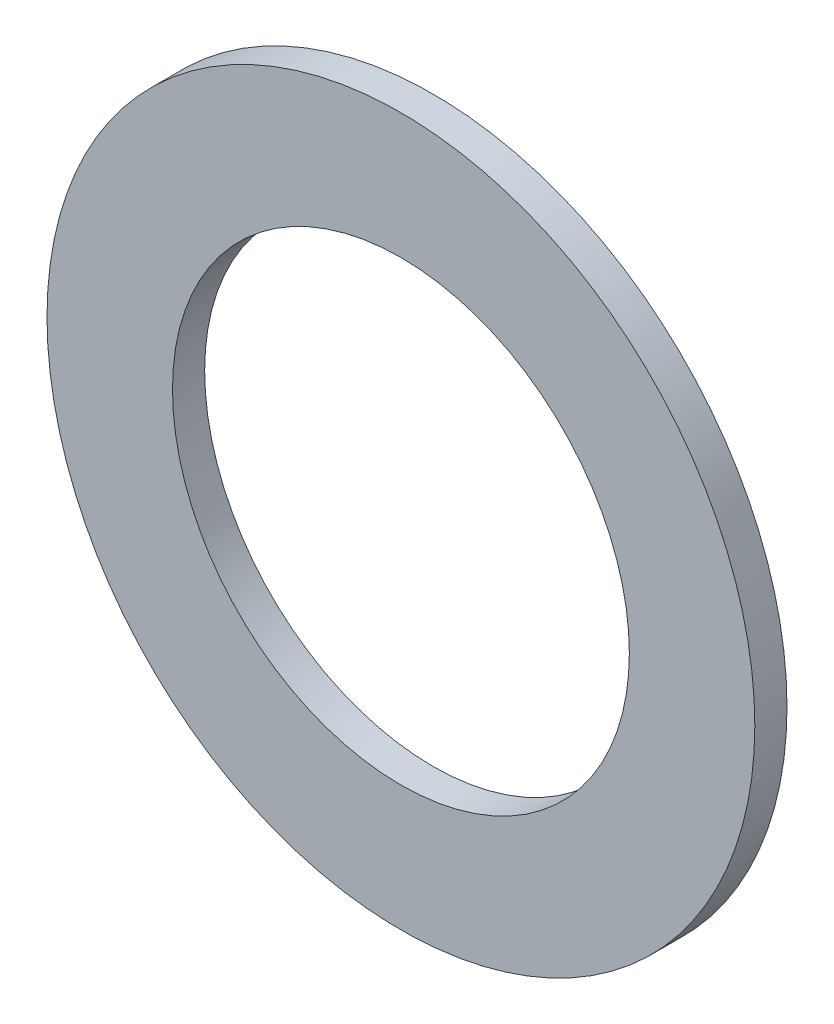
ISO-10303-21;
HEADER;
FILE_DESCRIPTION(('STEP AP214'),'2;1');
FILE_NAME('part.step','',(''),(''),'','','');
FILE_SCHEMA(('AUTOMOTIVE_DESIGN { 1 0 10303 214 1 1 1 1 }'));
ENDSEC;
DATA;
#1=APPLICATION_CONTEXT('core data for automotive mechanical design processes');
#2=APPLICATION_PROTOCOL_DEFINITION('international standard','automotive_design',2000,#1);
#3=PRODUCT_CONTEXT('',#1,'mechanical');
#4=PRODUCT('Part','Part','',(#3));
#5=PRODUCT_RELATED_PRODUCT_CATEGORY('part','',(#4));
#6=PRODUCT_DEFINITION_FORMATION('','',#4);
#7=PRODUCT_DEFINITION_CONTEXT('part definition',#1,'design');
#8=PRODUCT_DEFINITION('design','',#6,#7);
#9=PRODUCT_DEFINITION_SHAPE('','',#8);
#10=(LENGTH_UNIT() NAMED_UNIT(*) SI_UNIT(.MILLI.,.METRE.));
#11=(NAMED_UNIT(*) PLANE_ANGLE_UNIT() SI_UNIT($,.RADIAN.));
#12=(NAMED_UNIT(*) SI_UNIT($,.STERADIAN.) SOLID_ANGLE_UNIT());
#13=UNCERTAINTY_MEASURE_WITH_UNIT(LENGTH_MEASURE(1.E-05),#10,'distance_accuracy_value','');
#14=(GEOMETRIC_REPRESENTATION_CONTEXT(3) GLOBAL_UNCERTAINTY_ASSIGNED_CONTEXT((#13)) GLOBAL_UNIT_ASSIGNED_CONTEXT((#10,
#11,#12)) REPRESENTATION_CONTEXT('',''));
#15=CARTESIAN_POINT('',(0.,0.,0.));
#16=DIRECTION('',(0.,0.,1.));
#17=DIRECTION('',(1.,0.,0.));
#18=AXIS2_PLACEMENT_3D('',#15,#16,#17);
#19=CARTESIAN_POINT('',(-6.425,0.,0.5));
#20=DIRECTION('',(0.,0.,-1.));
#21=DIRECTION('',(-1.,0.,0.));
#22=AXIS2_PLACEMENT_3D('',#19,#20,#21);
#23=PLANE('',#22);
#24=CARTESIAN_POINT('',(-6.425,0.,0.5));
#25=DIRECTION('',(0.,0.,1.));
#26=DIRECTION('',(1.,0.,0.));
#27=AXIS2_PLACEMENT_3D('',#24,#25,#26);
#28=CIRCLE('',#27,3.55);
#29=CARTESIAN_POINT('',(-2.875,0.,0.5));
#30=VERTEX_POINT('',#29);
#31=EDGE_CURVE('E27',#30,#30,#28,.F.);
#32=ORIENTED_EDGE('',*,*,#31,.T.);
#33=EDGE_LOOP('',(#32));
#34=FACE_BOUND('',#33,.T.);
#35=CARTESIAN_POINT('',(-6.425,0.,0.5));
#36=DIRECTION('',(0.,0.,1.));
#37=DIRECTION('',(1.,0.,0.));
#38=AXIS2_PLACEMENT_3D('',#35,#36,#37);
#39=CIRCLE('',#38,5.5);
#40=CARTESIAN_POINT('',(-0.925,0.,0.5));
#41=VERTEX_POINT('',#40);
#42=EDGE_CURVE('E18',#41,#41,#39,.F.);
#43=ORIENTED_EDGE('',*,*,#42,.F.);
#44=EDGE_LOOP('',(#43));
#45=FACE_BOUND('',#44,.T.);
#46=ADVANCED_FACE('F15',(#34,#45),#23,.F.);
#47=CARTESIAN_POINT('',(-6.425,0.,0.));
#48=DIRECTION('',(0.,0.,1.));
#49=DIRECTION('',(1.,0.,0.));
#50=AXIS2_PLACEMENT_3D('',#47,#48,#49);
#51=CYLINDRICAL_SURFACE('',#50,5.5);
#52=ORIENTED_EDGE('',*,*,#42,.T.);
#53=EDGE_LOOP('',(#52));
#54=FACE_BOUND('',#53,.T.);
#55=CARTESIAN_POINT('',(-6.425,0.,0.));
#56=DIRECTION('',(0.,0.,1.));
#57=DIRECTION('',(1.,0.,0.));
#58=AXIS2_PLACEMENT_3D('',#55,#56,#57);
#59=CIRCLE('',#58,5.5);
#60=CARTESIAN_POINT('',(-0.925,0.,0.));
#61=VERTEX_POINT('',#60);
#62=EDGE_CURVE('E22',#61,#61,#59,.F.);
#63=ORIENTED_EDGE('',*,*,#62,.F.);
#64=EDGE_LOOP('',(#63));
#65=FACE_BOUND('',#64,.T.);
#66=ADVANCED_FACE('F35',(#54,#65),#51,.T.);
#67=CARTESIAN_POINT('',(-6.425,0.,0.));
#68=DIRECTION('',(0.,0.,1.));
#69=DIRECTION('',(1.,0.,0.));
#70=AXIS2_PLACEMENT_3D('',#67,#68,#69);
#71=CYLINDRICAL_SURFACE('',#70,3.55);
#72=CARTESIAN_POINT('',(-6.425,0.,0.));
#73=DIRECTION('',(0.,0.,1.));
#74=DIRECTION('',(1.,0.,0.));
#75=AXIS2_PLACEMENT_3D('',#72,#73,#74);
#76=CIRCLE('',#75,3.55);
#77=CARTESIAN_POINT('',(-2.875,0.,0.));
#78=VERTEX_POINT('',#77);
#79=EDGE_CURVE('E10',#78,#78,#76,.T.);
#80=ORIENTED_EDGE('',*,*,#79,.F.);
#81=EDGE_LOOP('',(#80));
#82=FACE_BOUND('',#81,.T.);
#83=ORIENTED_EDGE('',*,*,#31,.F.);
#84=EDGE_LOOP('',(#83));
#85=FACE_BOUND('',#84,.T.);
#86=ADVANCED_FACE('F43',(#82,#85),#71,.F.);
#87=CARTESIAN_POINT('',(-6.425,0.,0.));
#88=DIRECTION('',(0.,0.,-1.));
#89=DIRECTION('',(-1.,0.,0.));
#90=AXIS2_PLACEMENT_3D('',#87,#88,#89);
#91=PLANE('',#90);
#92=ORIENTED_EDGE('',*,*,#79,.T.);
#93=EDGE_LOOP('',(#92));
#94=FACE_BOUND('',#93,.T.);
#95=ORIENTED_EDGE('',*,*,#62,.T.);
#96=EDGE_LOOP('',(#95));
#97=FACE_BOUND('',#96,.T.);
#98=ADVANCED_FACE('F44',(#94,#97),#91,.T.);
#99=CLOSED_SHELL('',(#46,#66,#86,#98));
#100=MANIFOLD_SOLID_BREP('B1',#99);
#101=ADVANCED_BREP_SHAPE_REPRESENTATION('',(#18,#100),#14);
#102=SHAPE_DEFINITION_REPRESENTATION(#9,#101);
ENDSEC;
END-ISO-10303-21;
